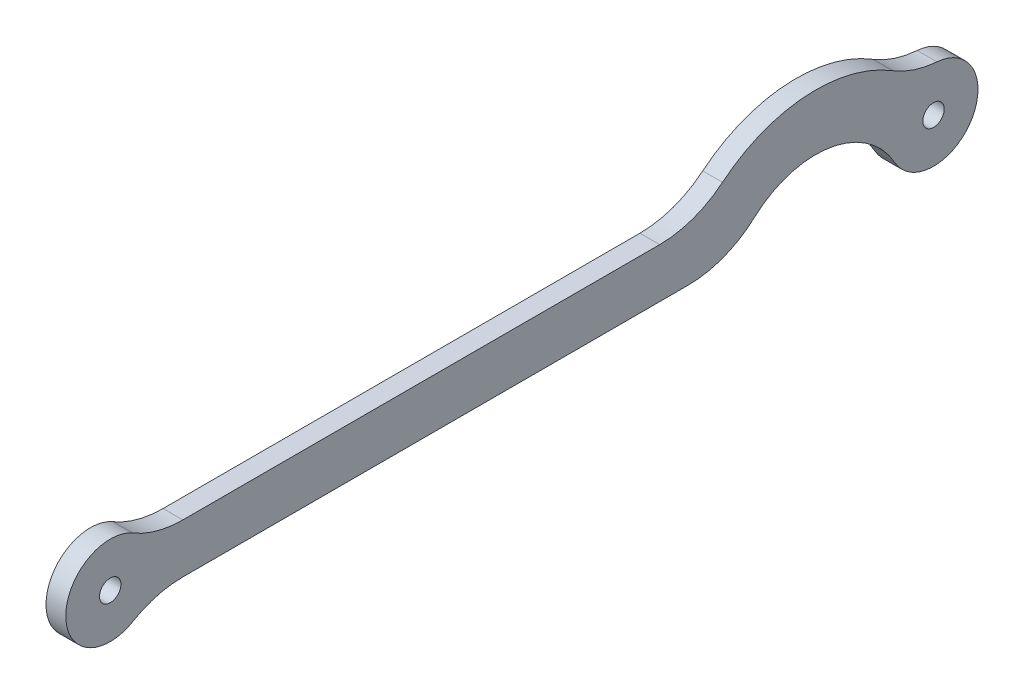
ISO-10303-21;
HEADER;
FILE_DESCRIPTION(('STEP AP214'),'2;1');
FILE_NAME('part.step','',(''),(''),'','','');
FILE_SCHEMA(('AUTOMOTIVE_DESIGN { 1 0 10303 214 1 1 1 1 }'));
ENDSEC;
DATA;
#1=APPLICATION_CONTEXT('core data for automotive mechanical design processes');
#2=APPLICATION_PROTOCOL_DEFINITION('international standard','automotive_design',2000,#1);
#3=PRODUCT_CONTEXT('',#1,'mechanical');
#4=PRODUCT('Part','Part','',(#3));
#5=PRODUCT_RELATED_PRODUCT_CATEGORY('part','',(#4));
#6=PRODUCT_DEFINITION_FORMATION('','',#4);
#7=PRODUCT_DEFINITION_CONTEXT('part definition',#1,'design');
#8=PRODUCT_DEFINITION('design','',#6,#7);
#9=PRODUCT_DEFINITION_SHAPE('','',#8);
#10=(LENGTH_UNIT() NAMED_UNIT(*) SI_UNIT(.MILLI.,.METRE.));
#11=(NAMED_UNIT(*) PLANE_ANGLE_UNIT() SI_UNIT($,.RADIAN.));
#12=(NAMED_UNIT(*) SI_UNIT($,.STERADIAN.) SOLID_ANGLE_UNIT());
#13=UNCERTAINTY_MEASURE_WITH_UNIT(LENGTH_MEASURE(1.E-05),#10,'distance_accuracy_value','');
#14=(GEOMETRIC_REPRESENTATION_CONTEXT(3) GLOBAL_UNCERTAINTY_ASSIGNED_CONTEXT((#13)) GLOBAL_UNIT_ASSIGNED_CONTEXT((#10,
#11,#12)) REPRESENTATION_CONTEXT('',''));
#15=CARTESIAN_POINT('',(0.,0.,0.));
#16=DIRECTION('',(0.,0.,1.));
#17=DIRECTION('',(1.,0.,0.));
#18=AXIS2_PLACEMENT_3D('',#15,#16,#17);
#19=CARTESIAN_POINT('',(-1.5,0.,0.));
#20=DIRECTION('',(1.,0.,0.));
#21=DIRECTION('',(0.,0.,-1.));
#22=AXIS2_PLACEMENT_3D('',#19,#20,#21);
#23=PLANE('',#22);
#24=CARTESIAN_POINT('',(-1.5,0.,-62.5));
#25=DIRECTION('',(-1.,0.,0.));
#26=DIRECTION('',(0.,0.,1.));
#27=AXIS2_PLACEMENT_3D('',#24,#25,#26);
#28=CIRCLE('',#27,1.62500000000001);
#29=CARTESIAN_POINT('',(-1.5,0.,-60.875));
#30=VERTEX_POINT('',#29);
#31=EDGE_CURVE('E155',#30,#30,#28,.F.);
#32=ORIENTED_EDGE('',*,*,#31,.T.);
#33=EDGE_LOOP('',(#32));
#34=FACE_BOUND('',#33,.T.);
#35=CARTESIAN_POINT('',(-1.5,0.,62.5));
#36=DIRECTION('',(-1.,0.,0.));
#37=DIRECTION('',(0.,0.,1.));
#38=AXIS2_PLACEMENT_3D('',#35,#36,#37);
#39=CIRCLE('',#38,1.62500000000001);
#40=CARTESIAN_POINT('',(-1.5,0.,64.125));
#41=VERTEX_POINT('',#40);
#42=EDGE_CURVE('E158',#41,#41,#39,.F.);
#43=ORIENTED_EDGE('',*,*,#42,.T.);
#44=EDGE_LOOP('',(#43));
#45=FACE_BOUND('',#44,.T.);
#46=CARTESIAN_POINT('',(-1.5,11.25,-25.2395531007896));
#47=DIRECTION('',(-1.,0.,0.));
#48=DIRECTION('',(0.,0.,1.));
#49=AXIS2_PLACEMENT_3D('',#46,#47,#48);
#50=CIRCLE('',#49,15.);
#51=CARTESIAN_POINT('',(-1.5,-3.75,-25.2395531007896));
#52=VERTEX_POINT('',#51);
#53=CARTESIAN_POINT('',(-1.5,0.163043478260873,-35.3429879169829));
#54=VERTEX_POINT('',#53);
#55=EDGE_CURVE('E19',#52,#54,#50,.F.);
#56=ORIENTED_EDGE('',*,*,#55,.F.);
#57=DIRECTION('',(0.,0.,1.));
#58=VECTOR('',#57,1.);
#59=CARTESIAN_POINT('',(-1.5,-3.75,0.));
#60=LINE('',#59,#58);
#61=CARTESIAN_POINT('',(-1.5,-3.75000000000001,51.4772961574757));
#62=VERTEX_POINT('',#61);
#63=EDGE_CURVE('E95',#52,#62,#60,.T.);
#64=ORIENTED_EDGE('',*,*,#63,.T.);
#65=CARTESIAN_POINT('',(-1.5,-18.75,51.4772961574757));
#66=DIRECTION('',(-1.,0.,0.));
#67=DIRECTION('',(0.,0.,1.));
#68=AXIS2_PLACEMENT_3D('',#65,#66,#67);
#69=CIRCLE('',#68,15.);
#70=CARTESIAN_POINT('',(-1.5,-5.81896551724139,59.079160876458));
#71=VERTEX_POINT('',#70);
#72=EDGE_CURVE('E162',#62,#71,#69,.F.);
#73=ORIENTED_EDGE('',*,*,#72,.T.);
#74=CARTESIAN_POINT('',(-1.5,0.,62.5));
#75=DIRECTION('',(-1.,0.,0.));
#76=DIRECTION('',(0.,0.,1.));
#77=AXIS2_PLACEMENT_3D('',#74,#75,#76);
#78=CIRCLE('',#77,6.75);
#79=CARTESIAN_POINT('',(-1.5,5.81896551724137,59.079160876458));
#80=VERTEX_POINT('',#79);
#81=EDGE_CURVE('E165',#80,#71,#78,.F.);
#82=ORIENTED_EDGE('',*,*,#81,.F.);
#83=CARTESIAN_POINT('',(-1.5,18.75,51.4772961574757));
#84=DIRECTION('',(-1.,0.,0.));
#85=DIRECTION('',(0.,0.,1.));
#86=AXIS2_PLACEMENT_3D('',#83,#84,#85);
#87=CIRCLE('',#86,15.);
#88=CARTESIAN_POINT('',(-1.5,3.74999999999999,51.4772961574757));
#89=VERTEX_POINT('',#88);
#90=EDGE_CURVE('E169',#80,#89,#87,.F.);
#91=ORIENTED_EDGE('',*,*,#90,.T.);
#92=DIRECTION('',(0.,0.,1.));
#93=VECTOR('',#92,1.);
#94=CARTESIAN_POINT('',(-1.5,3.75,0.));
#95=LINE('',#94,#93);
#96=CARTESIAN_POINT('',(-1.5,3.75,-20.9190312671727));
#97=VERTEX_POINT('',#96);
#98=EDGE_CURVE('E126',#97,#89,#95,.T.);
#99=ORIENTED_EDGE('',*,*,#98,.F.);
#100=CARTESIAN_POINT('',(-1.5,18.75,-20.9190312671727));
#101=DIRECTION('',(-1.,0.,0.));
#102=DIRECTION('',(0.,0.,1.));
#103=AXIS2_PLACEMENT_3D('',#100,#101,#102);
#104=CIRCLE('',#103,15.);
#105=CARTESIAN_POINT('',(-1.5,7.17281879194631,-30.4567917630065));
#106=VERTEX_POINT('',#105);
#107=EDGE_CURVE('E172',#97,#106,#104,.F.);
#108=ORIENTED_EDGE('',*,*,#107,.T.);
#109=CARTESIAN_POINT('',(-1.5,-10.,-44.6044698318267));
#110=DIRECTION('',(-1.,0.,0.));
#111=DIRECTION('',(0.,0.,1.));
#112=AXIS2_PLACEMENT_3D('',#109,#110,#111);
#113=CIRCLE('',#112,22.25);
#114=CARTESIAN_POINT('',(-1.5,8.92538102309322,-56.3045746660042));
#115=VERTEX_POINT('',#114);
#116=EDGE_CURVE('E175',#115,#106,#113,.F.);
#117=ORIENTED_EDGE('',*,*,#116,.F.);
#118=CARTESIAN_POINT('',(-1.5,21.6840648588864,-64.1922857901687));
#119=DIRECTION('',(1.,0.,0.));
#120=DIRECTION('',(0.,0.,-1.));
#121=AXIS2_PLACEMENT_3D('',#118,#119,#120);
#122=CIRCLE('',#121,15.);
#123=CARTESIAN_POINT('',(-1.5,6.72953736999922,-63.0251921417765));
#124=VERTEX_POINT('',#123);
#125=EDGE_CURVE('E179',#115,#124,#122,.T.);
#126=ORIENTED_EDGE('',*,*,#125,.T.);
#127=CARTESIAN_POINT('',(-1.5,0.,-62.5));
#128=DIRECTION('',(-1.,0.,0.));
#129=DIRECTION('',(0.,0.,1.));
#130=AXIS2_PLACEMENT_3D('',#127,#128,#129);
#131=CIRCLE('',#130,6.74999999999999);
#132=CARTESIAN_POINT('',(-1.5,-3.29268292682927,-56.6075693348698));
#133=VERTEX_POINT('',#132);
#134=EDGE_CURVE('E104',#133,#124,#131,.F.);
#135=ORIENTED_EDGE('',*,*,#134,.F.);
#136=CARTESIAN_POINT('',(-1.5,-10.,-44.6044698318267));
#137=DIRECTION('',(-1.,0.,0.));
#138=DIRECTION('',(0.,0.,1.));
#139=AXIS2_PLACEMENT_3D('',#136,#137,#138);
#140=CIRCLE('',#139,13.75);
#141=EDGE_CURVE('E100',#133,#54,#140,.F.);
#142=ORIENTED_EDGE('',*,*,#141,.T.);
#143=EDGE_LOOP('',(#56,#64,#73,#82,#91,#99,#108,#117,#126,#135,#142));
#144=FACE_BOUND('',#143,.T.);
#145=ADVANCED_FACE('F16',(#34,#45,#144),#23,.F.);
#146=CARTESIAN_POINT('',(1.5,-3.75,0.));
#147=DIRECTION('',(0.,1.,0.));
#148=DIRECTION('',(0.,0.,1.));
#149=AXIS2_PLACEMENT_3D('',#146,#147,#148);
#150=PLANE('',#149);
#151=DIRECTION('',(-1.,0.,0.));
#152=VECTOR('',#151,1.);
#153=CARTESIAN_POINT('',(1.5,-3.75000000000001,51.4772961574757));
#154=LINE('',#153,#152);
#155=CARTESIAN_POINT('',(1.5,-3.75000000000001,51.4772961574757));
#156=VERTEX_POINT('',#155);
#157=EDGE_CURVE('E164',#156,#62,#154,.T.);
#158=ORIENTED_EDGE('',*,*,#157,.T.);
#159=ORIENTED_EDGE('',*,*,#63,.F.);
#160=DIRECTION('',(-1.,0.,0.));
#161=VECTOR('',#160,1.);
#162=CARTESIAN_POINT('',(1.5,-3.75,-25.2395531007896));
#163=LINE('',#162,#161);
#164=CARTESIAN_POINT('',(1.5,-3.75,-25.2395531007896));
#165=VERTEX_POINT('',#164);
#166=EDGE_CURVE('E113',#165,#52,#163,.T.);
#167=ORIENTED_EDGE('',*,*,#166,.F.);
#168=DIRECTION('',(0.,0.,-1.));
#169=VECTOR('',#168,1.);
#170=CARTESIAN_POINT('',(1.5,-3.75000000000001,0.));
#171=LINE('',#170,#169);
#172=EDGE_CURVE('E154',#156,#165,#171,.T.);
#173=ORIENTED_EDGE('',*,*,#172,.F.);
#174=EDGE_LOOP('',(#158,#159,#167,#173));
#175=FACE_BOUND('',#174,.T.);
#176=ADVANCED_FACE('F228',(#175),#150,.F.);
#177=CARTESIAN_POINT('',(1.5,11.25,-25.2395531007896));
#178=DIRECTION('',(-1.,0.,0.));
#179=DIRECTION('',(0.,0.,1.));
#180=AXIS2_PLACEMENT_3D('',#177,#178,#179);
#181=CYLINDRICAL_SURFACE('',#180,15.);
#182=ORIENTED_EDGE('',*,*,#55,.T.);
#183=DIRECTION('',(-1.,0.,0.));
#184=VECTOR('',#183,1.);
#185=CARTESIAN_POINT('',(1.5,0.163043478260872,-35.3429879169829));
#186=LINE('',#185,#184);
#187=CARTESIAN_POINT('',(1.5,0.163043478260873,-35.3429879169829));
#188=VERTEX_POINT('',#187);
#189=EDGE_CURVE('E108',#54,#188,#186,.F.);
#190=ORIENTED_EDGE('',*,*,#189,.T.);
#191=CARTESIAN_POINT('',(1.5,11.25,-25.2395531007896));
#192=DIRECTION('',(-1.,0.,0.));
#193=DIRECTION('',(0.,0.,1.));
#194=AXIS2_PLACEMENT_3D('',#191,#192,#193);
#195=CIRCLE('',#194,15.);
#196=EDGE_CURVE('E152',#165,#188,#195,.F.);
#197=ORIENTED_EDGE('',*,*,#196,.F.);
#198=ORIENTED_EDGE('',*,*,#166,.T.);
#199=EDGE_LOOP('',(#182,#190,#197,#198));
#200=FACE_BOUND('',#199,.T.);
#201=ADVANCED_FACE('F110',(#200),#181,.T.);
#202=CARTESIAN_POINT('',(1.5,-10.,-44.6044698318267));
#203=DIRECTION('',(-1.,0.,0.));
#204=DIRECTION('',(0.,0.,1.));
#205=AXIS2_PLACEMENT_3D('',#202,#203,#204);
#206=CYLINDRICAL_SURFACE('',#205,13.75);
#207=ORIENTED_EDGE('',*,*,#189,.F.);
#208=ORIENTED_EDGE('',*,*,#141,.F.);
#209=DIRECTION('',(-1.,0.,0.));
#210=VECTOR('',#209,1.);
#211=CARTESIAN_POINT('',(1.5,-3.29268292682927,-56.6075693348698));
#212=LINE('',#211,#210);
#213=CARTESIAN_POINT('',(1.5,-3.29268292682927,-56.6075693348698));
#214=VERTEX_POINT('',#213);
#215=EDGE_CURVE('E119',#214,#133,#212,.T.);
#216=ORIENTED_EDGE('',*,*,#215,.F.);
#217=CARTESIAN_POINT('',(1.5,-10.,-44.6044698318267));
#218=DIRECTION('',(-1.,0.,0.));
#219=DIRECTION('',(0.,0.,1.));
#220=AXIS2_PLACEMENT_3D('',#217,#218,#219);
#221=CIRCLE('',#220,13.75);
#222=EDGE_CURVE('E116',#188,#214,#221,.T.);
#223=ORIENTED_EDGE('',*,*,#222,.F.);
#224=EDGE_LOOP('',(#207,#208,#216,#223));
#225=FACE_BOUND('',#224,.T.);
#226=ADVANCED_FACE('F114',(#225),#206,.F.);
#227=CARTESIAN_POINT('',(1.5,0.,-62.5));
#228=DIRECTION('',(-1.,0.,0.));
#229=DIRECTION('',(0.,0.,1.));
#230=AXIS2_PLACEMENT_3D('',#227,#228,#229);
#231=CYLINDRICAL_SURFACE('',#230,6.74999999999999);
#232=CARTESIAN_POINT('',(1.5,0.,-62.5));
#233=DIRECTION('',(-1.,0.,0.));
#234=DIRECTION('',(0.,0.,1.));
#235=AXIS2_PLACEMENT_3D('',#232,#233,#234);
#236=CIRCLE('',#235,6.74999999999999);
#237=CARTESIAN_POINT('',(1.5,6.72953736999922,-63.0251921417765));
#238=VERTEX_POINT('',#237);
#239=EDGE_CURVE('E148',#214,#238,#236,.F.);
#240=ORIENTED_EDGE('',*,*,#239,.F.);
#241=ORIENTED_EDGE('',*,*,#215,.T.);
#242=ORIENTED_EDGE('',*,*,#134,.T.);
#243=DIRECTION('',(1.,0.,0.));
#244=VECTOR('',#243,1.);
#245=CARTESIAN_POINT('',(1.5,6.72953736999922,-63.0251921417765));
#246=LINE('',#245,#244);
#247=EDGE_CURVE('E178',#124,#238,#246,.T.);
#248=ORIENTED_EDGE('',*,*,#247,.T.);
#249=EDGE_LOOP('',(#240,#241,#242,#248));
#250=FACE_BOUND('',#249,.T.);
#251=ADVANCED_FACE('F183',(#250),#231,.T.);
#252=CARTESIAN_POINT('',(1.5,21.6840648588864,-64.1922857901687));
#253=DIRECTION('',(1.,0.,0.));
#254=DIRECTION('',(0.,0.,-1.));
#255=AXIS2_PLACEMENT_3D('',#252,#253,#254);
#256=CYLINDRICAL_SURFACE('',#255,15.);
#257=ORIENTED_EDGE('',*,*,#247,.F.);
#258=ORIENTED_EDGE('',*,*,#125,.F.);
#259=DIRECTION('',(-1.,0.,0.));
#260=VECTOR('',#259,1.);
#261=CARTESIAN_POINT('',(1.5,8.92538102309322,-56.3045746660042));
#262=LINE('',#261,#260);
#263=CARTESIAN_POINT('',(1.5,8.92538102309322,-56.3045746660042));
#264=VERTEX_POINT('',#263);
#265=EDGE_CURVE('E174',#264,#115,#262,.T.);
#266=ORIENTED_EDGE('',*,*,#265,.F.);
#267=CARTESIAN_POINT('',(1.5,21.6840648588864,-64.1922857901687));
#268=DIRECTION('',(1.,0.,0.));
#269=DIRECTION('',(0.,0.,-1.));
#270=AXIS2_PLACEMENT_3D('',#267,#268,#269);
#271=CIRCLE('',#270,15.);
#272=EDGE_CURVE('E145',#238,#264,#271,.F.);
#273=ORIENTED_EDGE('',*,*,#272,.F.);
#274=EDGE_LOOP('',(#257,#258,#266,#273));
#275=FACE_BOUND('',#274,.T.);
#276=ADVANCED_FACE('F208',(#275),#256,.F.);
#277=CARTESIAN_POINT('',(1.5,-10.,-44.6044698318267));
#278=DIRECTION('',(-1.,0.,0.));
#279=DIRECTION('',(0.,0.,1.));
#280=AXIS2_PLACEMENT_3D('',#277,#278,#279);
#281=CYLINDRICAL_SURFACE('',#280,22.25);
#282=CARTESIAN_POINT('',(1.5,-10.,-44.6044698318267));
#283=DIRECTION('',(-1.,0.,0.));
#284=DIRECTION('',(0.,0.,1.));
#285=AXIS2_PLACEMENT_3D('',#282,#283,#284);
#286=CIRCLE('',#285,22.25);
#287=CARTESIAN_POINT('',(1.5,7.17281879194631,-30.4567917630065));
#288=VERTEX_POINT('',#287);
#289=EDGE_CURVE('E142',#264,#288,#286,.F.);
#290=ORIENTED_EDGE('',*,*,#289,.F.);
#291=ORIENTED_EDGE('',*,*,#265,.T.);
#292=ORIENTED_EDGE('',*,*,#116,.T.);
#293=DIRECTION('',(-1.,0.,0.));
#294=VECTOR('',#293,1.);
#295=CARTESIAN_POINT('',(1.5,7.17281879194631,-30.4567917630065));
#296=LINE('',#295,#294);
#297=EDGE_CURVE('E129',#106,#288,#296,.F.);
#298=ORIENTED_EDGE('',*,*,#297,.T.);
#299=EDGE_LOOP('',(#290,#291,#292,#298));
#300=FACE_BOUND('',#299,.T.);
#301=ADVANCED_FACE('F205',(#300),#281,.T.);
#302=CARTESIAN_POINT('',(1.5,18.75,-20.9190312671727));
#303=DIRECTION('',(-1.,0.,0.));
#304=DIRECTION('',(0.,0.,1.));
#305=AXIS2_PLACEMENT_3D('',#302,#303,#304);
#306=CYLINDRICAL_SURFACE('',#305,15.);
#307=ORIENTED_EDGE('',*,*,#297,.F.);
#308=ORIENTED_EDGE('',*,*,#107,.F.);
#309=DIRECTION('',(1.,0.,0.));
#310=VECTOR('',#309,1.);
#311=CARTESIAN_POINT('',(1.5,3.75,-20.9190312671727));
#312=LINE('',#311,#310);
#313=CARTESIAN_POINT('',(1.5,3.75,-20.9190312671727));
#314=VERTEX_POINT('',#313);
#315=EDGE_CURVE('E128',#314,#97,#312,.F.);
#316=ORIENTED_EDGE('',*,*,#315,.F.);
#317=CARTESIAN_POINT('',(1.5,18.75,-20.9190312671727));
#318=DIRECTION('',(-1.,0.,0.));
#319=DIRECTION('',(0.,0.,1.));
#320=AXIS2_PLACEMENT_3D('',#317,#318,#319);
#321=CIRCLE('',#320,15.);
#322=EDGE_CURVE('E139',#288,#314,#321,.T.);
#323=ORIENTED_EDGE('',*,*,#322,.F.);
#324=EDGE_LOOP('',(#307,#308,#316,#323));
#325=FACE_BOUND('',#324,.T.);
#326=ADVANCED_FACE('F213',(#325),#306,.F.);
#327=CARTESIAN_POINT('',(1.5,3.75,0.));
#328=DIRECTION('',(0.,1.,0.));
#329=DIRECTION('',(0.,0.,1.));
#330=AXIS2_PLACEMENT_3D('',#327,#328,#329);
#331=PLANE('',#330);
#332=DIRECTION('',(0.,0.,-1.));
#333=VECTOR('',#332,1.);
#334=CARTESIAN_POINT('',(1.5,3.75,0.));
#335=LINE('',#334,#333);
#336=CARTESIAN_POINT('',(1.5,3.75,51.4772961574757));
#337=VERTEX_POINT('',#336);
#338=EDGE_CURVE('E138',#314,#337,#335,.F.);
#339=ORIENTED_EDGE('',*,*,#338,.F.);
#340=ORIENTED_EDGE('',*,*,#315,.T.);
#341=ORIENTED_EDGE('',*,*,#98,.T.);
#342=DIRECTION('',(-1.,0.,0.));
#343=VECTOR('',#342,1.);
#344=CARTESIAN_POINT('',(1.5,3.74999999999999,51.4772961574757));
#345=LINE('',#344,#343);
#346=EDGE_CURVE('E171',#89,#337,#345,.F.);
#347=ORIENTED_EDGE('',*,*,#346,.T.);
#348=EDGE_LOOP('',(#339,#340,#341,#347));
#349=FACE_BOUND('',#348,.T.);
#350=ADVANCED_FACE('F216',(#349),#331,.T.);
#351=CARTESIAN_POINT('',(1.5,18.75,51.4772961574757));
#352=DIRECTION('',(-1.,0.,0.));
#353=DIRECTION('',(0.,0.,1.));
#354=AXIS2_PLACEMENT_3D('',#351,#352,#353);
#355=CYLINDRICAL_SURFACE('',#354,15.);
#356=ORIENTED_EDGE('',*,*,#346,.F.);
#357=ORIENTED_EDGE('',*,*,#90,.F.);
#358=DIRECTION('',(-1.,0.,0.));
#359=VECTOR('',#358,1.);
#360=CARTESIAN_POINT('',(1.5,5.81896551724137,59.079160876458));
#361=LINE('',#360,#359);
#362=CARTESIAN_POINT('',(1.5,5.81896551724137,59.079160876458));
#363=VERTEX_POINT('',#362);
#364=EDGE_CURVE('E168',#363,#80,#361,.T.);
#365=ORIENTED_EDGE('',*,*,#364,.F.);
#366=CARTESIAN_POINT('',(1.5,18.75,51.4772961574757));
#367=DIRECTION('',(-1.,0.,0.));
#368=DIRECTION('',(0.,0.,1.));
#369=AXIS2_PLACEMENT_3D('',#366,#367,#368);
#370=CIRCLE('',#369,15.);
#371=EDGE_CURVE('E136',#337,#363,#370,.T.);
#372=ORIENTED_EDGE('',*,*,#371,.F.);
#373=EDGE_LOOP('',(#356,#357,#365,#372));
#374=FACE_BOUND('',#373,.T.);
#375=ADVANCED_FACE('F221',(#374),#355,.F.);
#376=CARTESIAN_POINT('',(1.5,0.,62.5));
#377=DIRECTION('',(-1.,0.,0.));
#378=DIRECTION('',(0.,0.,1.));
#379=AXIS2_PLACEMENT_3D('',#376,#377,#378);
#380=CYLINDRICAL_SURFACE('',#379,6.75);
#381=ORIENTED_EDGE('',*,*,#81,.T.);
#382=DIRECTION('',(-1.,0.,0.));
#383=VECTOR('',#382,1.);
#384=CARTESIAN_POINT('',(1.5,-5.81896551724139,59.079160876458));
#385=LINE('',#384,#383);
#386=CARTESIAN_POINT('',(1.5,-5.81896551724139,59.079160876458));
#387=VERTEX_POINT('',#386);
#388=EDGE_CURVE('E161',#71,#387,#385,.F.);
#389=ORIENTED_EDGE('',*,*,#388,.T.);
#390=CARTESIAN_POINT('',(1.5,0.,62.5));
#391=DIRECTION('',(-1.,0.,0.));
#392=DIRECTION('',(0.,0.,1.));
#393=AXIS2_PLACEMENT_3D('',#390,#391,#392);
#394=CIRCLE('',#393,6.75);
#395=EDGE_CURVE('E34',#363,#387,#394,.F.);
#396=ORIENTED_EDGE('',*,*,#395,.F.);
#397=ORIENTED_EDGE('',*,*,#364,.T.);
#398=EDGE_LOOP('',(#381,#389,#396,#397));
#399=FACE_BOUND('',#398,.T.);
#400=ADVANCED_FACE('F223',(#399),#380,.T.);
#401=CARTESIAN_POINT('',(1.5,-18.75,51.4772961574757));
#402=DIRECTION('',(-1.,0.,0.));
#403=DIRECTION('',(0.,0.,1.));
#404=AXIS2_PLACEMENT_3D('',#401,#402,#403);
#405=CYLINDRICAL_SURFACE('',#404,15.);
#406=ORIENTED_EDGE('',*,*,#388,.F.);
#407=ORIENTED_EDGE('',*,*,#72,.F.);
#408=ORIENTED_EDGE('',*,*,#157,.F.);
#409=CARTESIAN_POINT('',(1.5,-18.75,51.4772961574757));
#410=DIRECTION('',(-1.,0.,0.));
#411=DIRECTION('',(0.,0.,1.));
#412=AXIS2_PLACEMENT_3D('',#409,#410,#411);
#413=CIRCLE('',#412,15.);
#414=EDGE_CURVE('E133',#387,#156,#413,.T.);
#415=ORIENTED_EDGE('',*,*,#414,.F.);
#416=EDGE_LOOP('',(#406,#407,#408,#415));
#417=FACE_BOUND('',#416,.T.);
#418=ADVANCED_FACE('F227',(#417),#405,.F.);
#419=CARTESIAN_POINT('',(1.5,0.,62.5));
#420=DIRECTION('',(-1.,0.,0.));
#421=DIRECTION('',(0.,0.,1.));
#422=AXIS2_PLACEMENT_3D('',#419,#420,#421);
#423=CYLINDRICAL_SURFACE('',#422,1.62500000000001);
#424=CARTESIAN_POINT('',(1.5,0.,62.5));
#425=DIRECTION('',(-1.,0.,0.));
#426=DIRECTION('',(0.,0.,1.));
#427=AXIS2_PLACEMENT_3D('',#424,#425,#426);
#428=CIRCLE('',#427,1.62500000000001);
#429=CARTESIAN_POINT('',(1.5,0.,64.125));
#430=VERTEX_POINT('',#429);
#431=EDGE_CURVE('E25',#430,#430,#428,.T.);
#432=ORIENTED_EDGE('',*,*,#431,.F.);
#433=EDGE_LOOP('',(#432));
#434=FACE_BOUND('',#433,.T.);
#435=ORIENTED_EDGE('',*,*,#42,.F.);
#436=EDGE_LOOP('',(#435));
#437=FACE_BOUND('',#436,.T.);
#438=ADVANCED_FACE('F244',(#434,#437),#423,.F.);
#439=CARTESIAN_POINT('',(1.5,0.,-62.5));
#440=DIRECTION('',(-1.,0.,0.));
#441=DIRECTION('',(0.,0.,1.));
#442=AXIS2_PLACEMENT_3D('',#439,#440,#441);
#443=CYLINDRICAL_SURFACE('',#442,1.62500000000001);
#444=CARTESIAN_POINT('',(1.5,0.,-62.5));
#445=DIRECTION('',(-1.,0.,0.));
#446=DIRECTION('',(0.,0.,1.));
#447=AXIS2_PLACEMENT_3D('',#444,#445,#446);
#448=CIRCLE('',#447,1.62500000000001);
#449=CARTESIAN_POINT('',(1.5,0.,-60.875));
#450=VERTEX_POINT('',#449);
#451=EDGE_CURVE('E11',#450,#450,#448,.T.);
#452=ORIENTED_EDGE('',*,*,#451,.F.);
#453=EDGE_LOOP('',(#452));
#454=FACE_BOUND('',#453,.T.);
#455=ORIENTED_EDGE('',*,*,#31,.F.);
#456=EDGE_LOOP('',(#455));
#457=FACE_BOUND('',#456,.T.);
#458=ADVANCED_FACE('F238',(#454,#457),#443,.F.);
#459=CARTESIAN_POINT('',(1.5,0.,0.));
#460=DIRECTION('',(1.,0.,0.));
#461=DIRECTION('',(0.,0.,-1.));
#462=AXIS2_PLACEMENT_3D('',#459,#460,#461);
#463=PLANE('',#462);
#464=ORIENTED_EDGE('',*,*,#451,.T.);
#465=EDGE_LOOP('',(#464));
#466=FACE_BOUND('',#465,.T.);
#467=ORIENTED_EDGE('',*,*,#431,.T.);
#468=EDGE_LOOP('',(#467));
#469=FACE_BOUND('',#468,.T.);
#470=ORIENTED_EDGE('',*,*,#395,.T.);
#471=ORIENTED_EDGE('',*,*,#414,.T.);
#472=ORIENTED_EDGE('',*,*,#172,.T.);
#473=ORIENTED_EDGE('',*,*,#196,.T.);
#474=ORIENTED_EDGE('',*,*,#222,.T.);
#475=ORIENTED_EDGE('',*,*,#239,.T.);
#476=ORIENTED_EDGE('',*,*,#272,.T.);
#477=ORIENTED_EDGE('',*,*,#289,.T.);
#478=ORIENTED_EDGE('',*,*,#322,.T.);
#479=ORIENTED_EDGE('',*,*,#338,.T.);
#480=ORIENTED_EDGE('',*,*,#371,.T.);
#481=EDGE_LOOP('',(#470,#471,#472,#473,#474,#475,#476,#477,#478,#479,#480));
#482=FACE_BOUND('',#481,.T.);
#483=ADVANCED_FACE('F186',(#466,#469,#482),#463,.T.);
#484=CLOSED_SHELL('',(#145,#176,#201,#226,#251,#276,#301,#326,#350,#375,#400,#418,#438,#458,#483));
#485=MANIFOLD_SOLID_BREP('B1',#484);
#486=ADVANCED_BREP_SHAPE_REPRESENTATION('',(#18,#485),#14);
#487=SHAPE_DEFINITION_REPRESENTATION(#9,#486);
ENDSEC;
END-ISO-10303-21;
